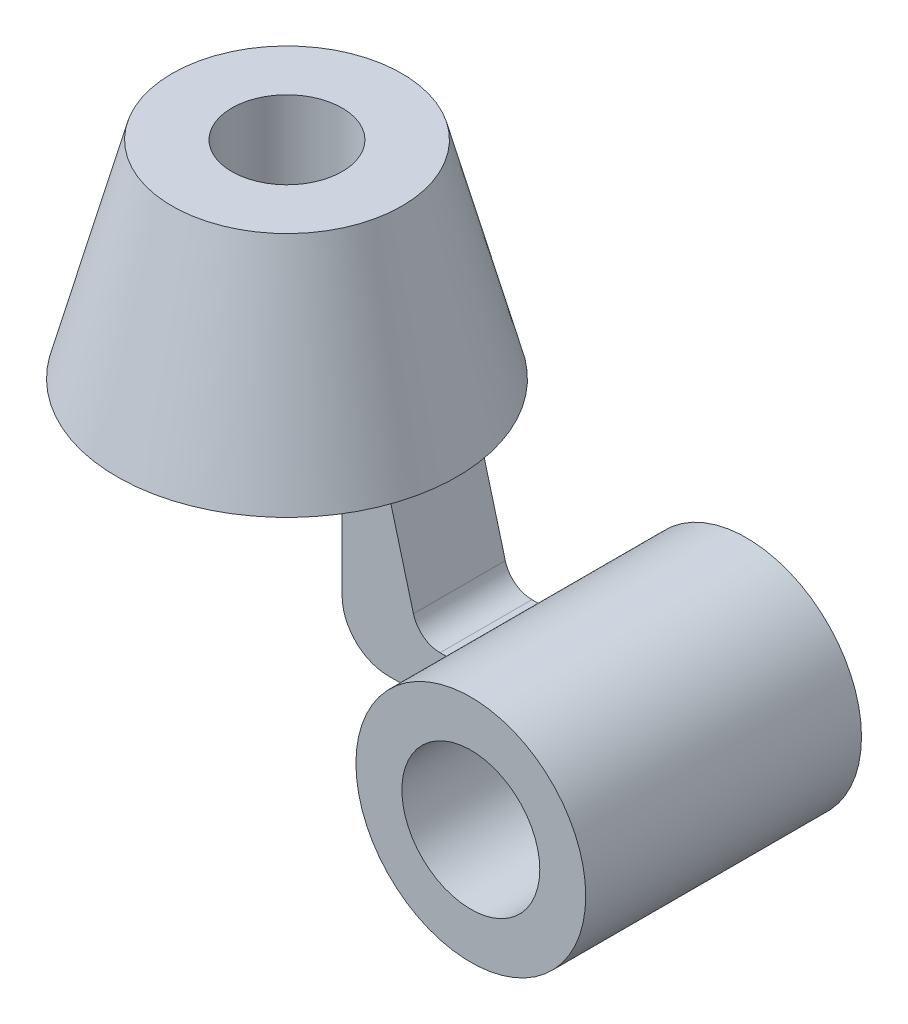
ISO-10303-21;
HEADER;
FILE_DESCRIPTION(('STEP AP214'),'2;1');
FILE_NAME('part.step','',(''),(''),'','','');
FILE_SCHEMA(('AUTOMOTIVE_DESIGN { 1 0 10303 214 1 1 1 1 }'));
ENDSEC;
DATA;
#1=APPLICATION_CONTEXT('core data for automotive mechanical design processes');
#2=APPLICATION_PROTOCOL_DEFINITION('international standard','automotive_design',2000,#1);
#3=PRODUCT_CONTEXT('',#1,'mechanical');
#4=PRODUCT('Part','Part','',(#3));
#5=PRODUCT_RELATED_PRODUCT_CATEGORY('part','',(#4));
#6=PRODUCT_DEFINITION_FORMATION('','',#4);
#7=PRODUCT_DEFINITION_CONTEXT('part definition',#1,'design');
#8=PRODUCT_DEFINITION('design','',#6,#7);
#9=PRODUCT_DEFINITION_SHAPE('','',#8);
#10=(LENGTH_UNIT() NAMED_UNIT(*) SI_UNIT(.MILLI.,.METRE.));
#11=(NAMED_UNIT(*) PLANE_ANGLE_UNIT() SI_UNIT($,.RADIAN.));
#12=(NAMED_UNIT(*) SI_UNIT($,.STERADIAN.) SOLID_ANGLE_UNIT());
#13=UNCERTAINTY_MEASURE_WITH_UNIT(LENGTH_MEASURE(1.E-05),#10,'distance_accuracy_value','');
#14=(GEOMETRIC_REPRESENTATION_CONTEXT(3) GLOBAL_UNCERTAINTY_ASSIGNED_CONTEXT((#13)) GLOBAL_UNIT_ASSIGNED_CONTEXT((#10,
#11,#12)) REPRESENTATION_CONTEXT('',''));
#15=CARTESIAN_POINT('',(0.,0.,0.));
#16=DIRECTION('',(0.,0.,1.));
#17=DIRECTION('',(1.,0.,0.));
#18=AXIS2_PLACEMENT_3D('',#15,#16,#17);
#19=CARTESIAN_POINT('',(50.5747092562656,-35.,10.));
#20=DIRECTION('',(0.,1.,0.));
#21=DIRECTION('',(-1.,0.,0.));
#22=AXIS2_PLACEMENT_3D('',#19,#20,#21);
#23=PLANE('',#22);
#24=DIRECTION('',(0.,0.,-1.));
#25=VECTOR('',#24,1.);
#26=CARTESIAN_POINT('',(45.,-35.,30.));
#27=LINE('',#26,#25);
#28=CARTESIAN_POINT('',(45.,-35.,10.));
#29=VERTEX_POINT('',#28);
#30=CARTESIAN_POINT('',(45.,-35.,-10.));
#31=VERTEX_POINT('',#30);
#32=EDGE_CURVE('E69',#29,#31,#27,.T.);
#33=ORIENTED_EDGE('',*,*,#32,.F.);
#34=DIRECTION('',(1.,0.,0.));
#35=VECTOR('',#34,1.);
#36=CARTESIAN_POINT('',(50.5747092562656,-35.,10.));
#37=LINE('',#36,#35);
#38=CARTESIAN_POINT('',(32.0000000000001,-35.,10.));
#39=VERTEX_POINT('',#38);
#40=EDGE_CURVE('E149',#39,#29,#37,.T.);
#41=ORIENTED_EDGE('',*,*,#40,.F.);
#42=DIRECTION('',(0.,0.,-1.));
#43=VECTOR('',#42,1.);
#44=CARTESIAN_POINT('',(32.0000000000001,-35.,10.));
#45=LINE('',#44,#43);
#46=CARTESIAN_POINT('',(32.0000000000001,-35.,-10.));
#47=VERTEX_POINT('',#46);
#48=EDGE_CURVE('E195',#39,#47,#45,.T.);
#49=ORIENTED_EDGE('',*,*,#48,.T.);
#50=DIRECTION('',(1.,0.,0.));
#51=VECTOR('',#50,1.);
#52=CARTESIAN_POINT('',(50.5747092562656,-35.,-10.));
#53=LINE('',#52,#51);
#54=EDGE_CURVE('E122',#47,#31,#53,.T.);
#55=ORIENTED_EDGE('',*,*,#54,.T.);
#56=EDGE_LOOP('',(#33,#41,#49,#55));
#57=FACE_BOUND('',#56,.T.);
#58=ADVANCED_FACE('F45',(#57),#23,.F.);
#59=CARTESIAN_POINT('',(43.3026917386517,-25.,10.));
#60=DIRECTION('',(0.,-1.,0.));
#61=DIRECTION('',(0.,0.,-1.));
#62=AXIS2_PLACEMENT_3D('',#59,#60,#61);
#63=PLANE('',#62);
#64=DIRECTION('',(0.,0.,-1.));
#65=VECTOR('',#64,1.);
#66=CARTESIAN_POINT('',(47.0871215252208,-25.,30.));
#67=LINE('',#66,#65);
#68=CARTESIAN_POINT('',(47.0871215252208,-25.,-10.));
#69=VERTEX_POINT('',#68);
#70=CARTESIAN_POINT('',(47.0871215252208,-25.,10.));
#71=VERTEX_POINT('',#70);
#72=EDGE_CURVE('E125',#69,#71,#67,.F.);
#73=ORIENTED_EDGE('',*,*,#72,.F.);
#74=DIRECTION('',(-1.,0.,0.));
#75=VECTOR('',#74,1.);
#76=CARTESIAN_POINT('',(43.3026917386517,-25.,-10.));
#77=LINE('',#76,#75);
#78=CARTESIAN_POINT('',(43.3026917386517,-25.,-10.));
#79=VERTEX_POINT('',#78);
#80=EDGE_CURVE('E112',#69,#79,#77,.T.);
#81=ORIENTED_EDGE('',*,*,#80,.T.);
#82=DIRECTION('',(0.,0.,-1.));
#83=VECTOR('',#82,1.);
#84=CARTESIAN_POINT('',(43.3026917386517,-25.,10.));
#85=LINE('',#84,#83);
#86=CARTESIAN_POINT('',(43.3026917386517,-25.,10.));
#87=VERTEX_POINT('',#86);
#88=EDGE_CURVE('E192',#87,#79,#85,.T.);
#89=ORIENTED_EDGE('',*,*,#88,.F.);
#90=DIRECTION('',(-1.,0.,0.));
#91=VECTOR('',#90,1.);
#92=CARTESIAN_POINT('',(43.3026917386517,-25.,10.));
#93=LINE('',#92,#91);
#94=EDGE_CURVE('E127',#71,#87,#93,.T.);
#95=ORIENTED_EDGE('',*,*,#94,.F.);
#96=EDGE_LOOP('',(#73,#81,#89,#95));
#97=FACE_BOUND('',#96,.T.);
#98=ADVANCED_FACE('F126',(#97),#63,.F.);
#99=CARTESIAN_POINT('',(25.,45.,0.));
#100=DIRECTION('',(0.,-1.,0.));
#101=DIRECTION('',(1.,0.,0.));
#102=AXIS2_PLACEMENT_3D('',#99,#100,#101);
#103=PLANE('',#102);
#104=CARTESIAN_POINT('',(0.,45.,0.));
#105=DIRECTION('',(0.,1.,0.));
#106=DIRECTION('',(-1.,0.,0.));
#107=AXIS2_PLACEMENT_3D('',#104,#105,#106);
#108=CIRCLE('',#107,12.);
#109=CARTESIAN_POINT('',(-12.,45.,0.));
#110=VERTEX_POINT('',#109);
#111=EDGE_CURVE('E203',#110,#110,#108,.T.);
#112=ORIENTED_EDGE('',*,*,#111,.F.);
#113=EDGE_LOOP('',(#112));
#114=FACE_BOUND('',#113,.T.);
#115=CARTESIAN_POINT('',(0.,45.,0.));
#116=DIRECTION('',(0.,1.,0.));
#117=DIRECTION('',(-1.,0.,0.));
#118=AXIS2_PLACEMENT_3D('',#115,#116,#117);
#119=CIRCLE('',#118,25.);
#120=CARTESIAN_POINT('',(-25.,45.,0.));
#121=VERTEX_POINT('',#120);
#122=EDGE_CURVE('E208',#121,#121,#119,.T.);
#123=ORIENTED_EDGE('',*,*,#122,.T.);
#124=EDGE_LOOP('',(#123));
#125=FACE_BOUND('',#124,.T.);
#126=ADVANCED_FACE('F47',(#114,#125),#103,.F.);
#127=CARTESIAN_POINT('',(0.,0.,0.));
#128=DIRECTION('',(0.,1.,0.));
#129=DIRECTION('',(-1.,0.,0.));
#130=AXIS2_PLACEMENT_3D('',#127,#128,#129);
#131=PLANE('',#130);
#132=DIRECTION('',(0.,0.,-1.));
#133=VECTOR('',#132,1.);
#134=CARTESIAN_POINT('',(22.,0.,10.));
#135=LINE('',#134,#133);
#136=CARTESIAN_POINT('',(22.,0.,10.));
#137=VERTEX_POINT('',#136);
#138=CARTESIAN_POINT('',(22.,0.,-10.));
#139=VERTEX_POINT('',#138);
#140=EDGE_CURVE('E165',#137,#139,#135,.T.);
#141=ORIENTED_EDGE('',*,*,#140,.F.);
#142=DIRECTION('',(-1.,0.,0.));
#143=VECTOR('',#142,1.);
#144=CARTESIAN_POINT('',(22.,0.,10.));
#145=LINE('',#144,#143);
#146=CARTESIAN_POINT('',(32.,0.,10.));
#147=VERTEX_POINT('',#146);
#148=EDGE_CURVE('E161',#147,#137,#145,.T.);
#149=ORIENTED_EDGE('',*,*,#148,.F.);
#150=DIRECTION('',(0.,0.,-1.));
#151=VECTOR('',#150,1.);
#152=CARTESIAN_POINT('',(32.,0.,10.));
#153=LINE('',#152,#151);
#154=CARTESIAN_POINT('',(32.,0.,-10.));
#155=VERTEX_POINT('',#154);
#156=EDGE_CURVE('E185',#147,#155,#153,.T.);
#157=ORIENTED_EDGE('',*,*,#156,.T.);
#158=DIRECTION('',(-1.,0.,0.));
#159=VECTOR('',#158,1.);
#160=CARTESIAN_POINT('',(22.,0.,-10.));
#161=LINE('',#160,#159);
#162=EDGE_CURVE('E146',#155,#139,#161,.T.);
#163=ORIENTED_EDGE('',*,*,#162,.T.);
#164=EDGE_LOOP('',(#141,#149,#157,#163));
#165=FACE_BOUND('',#164,.T.);
#166=CARTESIAN_POINT('',(0.,0.,0.));
#167=DIRECTION('',(0.,1.,0.));
#168=DIRECTION('',(-1.,0.,0.));
#169=AXIS2_PLACEMENT_3D('',#166,#167,#168);
#170=CIRCLE('',#169,12.);
#171=CARTESIAN_POINT('',(-12.,0.,0.));
#172=VERTEX_POINT('',#171);
#173=EDGE_CURVE('E204',#172,#172,#170,.T.);
#174=ORIENTED_EDGE('',*,*,#173,.T.);
#175=EDGE_LOOP('',(#174));
#176=FACE_BOUND('',#175,.T.);
#177=CARTESIAN_POINT('',(0.,0.,0.));
#178=DIRECTION('',(0.,1.,0.));
#179=DIRECTION('',(-1.,0.,0.));
#180=AXIS2_PLACEMENT_3D('',#177,#178,#179);
#181=CIRCLE('',#180,37.);
#182=CARTESIAN_POINT('',(-37.,0.,0.));
#183=VERTEX_POINT('',#182);
#184=EDGE_CURVE('E54',#183,#183,#181,.T.);
#185=ORIENTED_EDGE('',*,*,#184,.F.);
#186=EDGE_LOOP('',(#185));
#187=FACE_BOUND('',#186,.T.);
#188=ADVANCED_FACE('F220',(#165,#176,#187),#131,.F.);
#189=CARTESIAN_POINT('',(0.,0.,0.));
#190=DIRECTION('',(0.,-1.,0.));
#191=DIRECTION('',(1.,0.,0.));
#192=AXIS2_PLACEMENT_3D('',#189,#190,#191);
#193=CONICAL_SURFACE('',#192,37.,0.260602391747341);
#194=ORIENTED_EDGE('',*,*,#122,.F.);
#195=EDGE_LOOP('',(#194));
#196=FACE_BOUND('',#195,.T.);
#197=ORIENTED_EDGE('',*,*,#184,.T.);
#198=EDGE_LOOP('',(#197));
#199=FACE_BOUND('',#198,.T.);
#200=ADVANCED_FACE('F218',(#196,#199),#193,.T.);
#201=CARTESIAN_POINT('',(0.,0.,0.));
#202=DIRECTION('',(0.,1.,0.));
#203=DIRECTION('',(-1.,0.,0.));
#204=AXIS2_PLACEMENT_3D('',#201,#202,#203);
#205=CYLINDRICAL_SURFACE('',#204,12.);
#206=ORIENTED_EDGE('',*,*,#173,.F.);
#207=EDGE_LOOP('',(#206));
#208=FACE_BOUND('',#207,.T.);
#209=ORIENTED_EDGE('',*,*,#111,.T.);
#210=EDGE_LOOP('',(#209));
#211=FACE_BOUND('',#210,.T.);
#212=ADVANCED_FACE('F228',(#208,#211),#205,.F.);
#213=CARTESIAN_POINT('',(22.,-24.9999999999999,10.));
#214=DIRECTION('',(1.,0.,0.));
#215=DIRECTION('',(0.,0.,-1.));
#216=AXIS2_PLACEMENT_3D('',#213,#214,#215);
#217=PLANE('',#216);
#218=DIRECTION('',(0.,-1.,0.));
#219=VECTOR('',#218,1.);
#220=CARTESIAN_POINT('',(22.,-24.9999999999999,-10.));
#221=LINE('',#220,#219);
#222=CARTESIAN_POINT('',(22.,-25.,-10.));
#223=VERTEX_POINT('',#222);
#224=EDGE_CURVE('E137',#139,#223,#221,.T.);
#225=ORIENTED_EDGE('',*,*,#224,.T.);
#226=DIRECTION('',(0.,0.,-1.));
#227=VECTOR('',#226,1.);
#228=CARTESIAN_POINT('',(22.,-25.,10.));
#229=LINE('',#228,#227);
#230=CARTESIAN_POINT('',(22.,-25.,10.));
#231=VERTEX_POINT('',#230);
#232=EDGE_CURVE('E199',#231,#223,#229,.T.);
#233=ORIENTED_EDGE('',*,*,#232,.F.);
#234=DIRECTION('',(0.,-1.,0.));
#235=VECTOR('',#234,1.);
#236=CARTESIAN_POINT('',(22.,-24.9999999999999,10.));
#237=LINE('',#236,#235);
#238=EDGE_CURVE('E141',#137,#231,#237,.T.);
#239=ORIENTED_EDGE('',*,*,#238,.F.);
#240=ORIENTED_EDGE('',*,*,#140,.T.);
#241=EDGE_LOOP('',(#225,#233,#239,#240));
#242=FACE_BOUND('',#241,.T.);
#243=ADVANCED_FACE('F247',(#242),#217,.F.);
#244=CARTESIAN_POINT('',(32.,-25.,10.));
#245=DIRECTION('',(0.,0.,-1.));
#246=DIRECTION('',(-1.,0.,0.));
#247=AXIS2_PLACEMENT_3D('',#244,#245,#246);
#248=CYLINDRICAL_SURFACE('',#247,10.);
#249=CARTESIAN_POINT('',(32.,-25.,-10.));
#250=DIRECTION('',(0.,0.,1.));
#251=DIRECTION('',(-1.,0.,0.));
#252=AXIS2_PLACEMENT_3D('',#249,#250,#251);
#253=CIRCLE('',#252,10.);
#254=EDGE_CURVE('E169',#223,#47,#253,.T.);
#255=ORIENTED_EDGE('',*,*,#254,.T.);
#256=ORIENTED_EDGE('',*,*,#48,.F.);
#257=CARTESIAN_POINT('',(32.,-25.,10.));
#258=DIRECTION('',(0.,0.,1.));
#259=DIRECTION('',(-1.,0.,0.));
#260=AXIS2_PLACEMENT_3D('',#257,#258,#259);
#261=CIRCLE('',#260,10.);
#262=EDGE_CURVE('E145',#231,#39,#261,.T.);
#263=ORIENTED_EDGE('',*,*,#262,.F.);
#264=ORIENTED_EDGE('',*,*,#232,.T.);
#265=EDGE_LOOP('',(#255,#256,#263,#264));
#266=FACE_BOUND('',#265,.T.);
#267=ADVANCED_FACE('F243',(#266),#248,.T.);
#268=CARTESIAN_POINT('',(43.3026917386517,-19.,10.));
#269=DIRECTION('',(0.,0.,-1.));
#270=DIRECTION('',(-1.,0.,0.));
#271=AXIS2_PLACEMENT_3D('',#268,#269,#270);
#272=CYLINDRICAL_SURFACE('',#271,6.);
#273=CARTESIAN_POINT('',(43.3026917386517,-19.,-10.));
#274=DIRECTION('',(0.,0.,-1.));
#275=DIRECTION('',(1.,0.,0.));
#276=AXIS2_PLACEMENT_3D('',#273,#274,#275);
#277=CIRCLE('',#276,6.);
#278=CARTESIAN_POINT('',(37.5071367809173,-20.552914270615,-10.));
#279=VERTEX_POINT('',#278);
#280=EDGE_CURVE('E117',#79,#279,#277,.T.);
#281=ORIENTED_EDGE('',*,*,#280,.T.);
#282=DIRECTION('',(0.,0.,-1.));
#283=VECTOR('',#282,1.);
#284=CARTESIAN_POINT('',(37.5071367809173,-20.552914270615,10.));
#285=LINE('',#284,#283);
#286=CARTESIAN_POINT('',(37.5071367809173,-20.552914270615,10.));
#287=VERTEX_POINT('',#286);
#288=EDGE_CURVE('E188',#287,#279,#285,.T.);
#289=ORIENTED_EDGE('',*,*,#288,.F.);
#290=CARTESIAN_POINT('',(43.3026917386517,-19.,10.));
#291=DIRECTION('',(0.,0.,-1.));
#292=DIRECTION('',(1.,0.,0.));
#293=AXIS2_PLACEMENT_3D('',#290,#291,#292);
#294=CIRCLE('',#293,6.);
#295=EDGE_CURVE('E154',#87,#287,#294,.T.);
#296=ORIENTED_EDGE('',*,*,#295,.F.);
#297=ORIENTED_EDGE('',*,*,#88,.T.);
#298=EDGE_LOOP('',(#281,#289,#296,#297));
#299=FACE_BOUND('',#298,.T.);
#300=ADVANCED_FACE('F246',(#299),#272,.F.);
#301=CARTESIAN_POINT('',(32.,0.,10.));
#302=DIRECTION('',(-0.96592582628907,-0.258819045102514,0.));
#303=DIRECTION('',(0.258819045102514,-0.96592582628907,0.));
#304=AXIS2_PLACEMENT_3D('',#301,#302,#303);
#305=PLANE('',#304);
#306=DIRECTION('',(-0.258819045102514,0.96592582628907,0.));
#307=VECTOR('',#306,1.);
#308=CARTESIAN_POINT('',(32.,0.,-10.));
#309=LINE('',#308,#307);
#310=EDGE_CURVE('E176',#279,#155,#309,.T.);
#311=ORIENTED_EDGE('',*,*,#310,.T.);
#312=ORIENTED_EDGE('',*,*,#156,.F.);
#313=DIRECTION('',(-0.258819045102514,0.96592582628907,0.));
#314=VECTOR('',#313,1.);
#315=CARTESIAN_POINT('',(32.,0.,10.));
#316=LINE('',#315,#314);
#317=EDGE_CURVE('E157',#287,#147,#316,.T.);
#318=ORIENTED_EDGE('',*,*,#317,.F.);
#319=ORIENTED_EDGE('',*,*,#288,.T.);
#320=EDGE_LOOP('',(#311,#312,#318,#319));
#321=FACE_BOUND('',#320,.T.);
#322=ADVANCED_FACE('F294',(#321),#305,.F.);
#323=CARTESIAN_POINT('',(43.3026917386517,-19.,10.));
#324=DIRECTION('',(0.,0.,1.));
#325=DIRECTION('',(1.,0.,0.));
#326=AXIS2_PLACEMENT_3D('',#323,#324,#325);
#327=PLANE('',#326);
#328=ORIENTED_EDGE('',*,*,#40,.T.);
#329=CARTESIAN_POINT('',(70.,-35.,10.));
#330=DIRECTION('',(0.,0.,1.));
#331=DIRECTION('',(1.,0.,0.));
#332=AXIS2_PLACEMENT_3D('',#329,#330,#331);
#333=CIRCLE('',#332,25.);
#334=EDGE_CURVE('E61',#29,#71,#333,.F.);
#335=ORIENTED_EDGE('',*,*,#334,.T.);
#336=ORIENTED_EDGE('',*,*,#94,.T.);
#337=ORIENTED_EDGE('',*,*,#295,.T.);
#338=ORIENTED_EDGE('',*,*,#317,.T.);
#339=ORIENTED_EDGE('',*,*,#148,.T.);
#340=ORIENTED_EDGE('',*,*,#238,.T.);
#341=ORIENTED_EDGE('',*,*,#262,.T.);
#342=EDGE_LOOP('',(#328,#335,#336,#337,#338,#339,#340,#341));
#343=FACE_BOUND('',#342,.T.);
#344=ADVANCED_FACE('F301',(#343),#327,.T.);
#345=CARTESIAN_POINT('',(43.3026917386517,-19.,-10.));
#346=DIRECTION('',(0.,0.,1.));
#347=DIRECTION('',(1.,0.,0.));
#348=AXIS2_PLACEMENT_3D('',#345,#346,#347);
#349=PLANE('',#348);
#350=CARTESIAN_POINT('',(70.,-35.,-10.));
#351=DIRECTION('',(0.,0.,1.));
#352=DIRECTION('',(1.,0.,0.));
#353=AXIS2_PLACEMENT_3D('',#350,#351,#352);
#354=CIRCLE('',#353,25.);
#355=EDGE_CURVE('E11',#31,#69,#354,.F.);
#356=ORIENTED_EDGE('',*,*,#355,.F.);
#357=ORIENTED_EDGE('',*,*,#54,.F.);
#358=ORIENTED_EDGE('',*,*,#254,.F.);
#359=ORIENTED_EDGE('',*,*,#224,.F.);
#360=ORIENTED_EDGE('',*,*,#162,.F.);
#361=ORIENTED_EDGE('',*,*,#310,.F.);
#362=ORIENTED_EDGE('',*,*,#280,.F.);
#363=ORIENTED_EDGE('',*,*,#80,.F.);
#364=EDGE_LOOP('',(#356,#357,#358,#359,#360,#361,#362,#363));
#365=FACE_BOUND('',#364,.T.);
#366=ADVANCED_FACE('F114',(#365),#349,.F.);
#367=CARTESIAN_POINT('',(70.,-35.,30.));
#368=DIRECTION('',(0.,0.,1.));
#369=DIRECTION('',(1.,0.,0.));
#370=AXIS2_PLACEMENT_3D('',#367,#368,#369);
#371=PLANE('',#370);
#372=CARTESIAN_POINT('',(70.,-35.,30.));
#373=DIRECTION('',(0.,0.,1.));
#374=DIRECTION('',(1.,0.,0.));
#375=AXIS2_PLACEMENT_3D('',#372,#373,#374);
#376=CIRCLE('',#375,25.);
#377=CARTESIAN_POINT('',(95.,-35.,30.));
#378=VERTEX_POINT('',#377);
#379=EDGE_CURVE('E130',#378,#378,#376,.T.);
#380=ORIENTED_EDGE('',*,*,#379,.T.);
#381=EDGE_LOOP('',(#380));
#382=FACE_BOUND('',#381,.T.);
#383=CARTESIAN_POINT('',(70.,-35.,30.));
#384=DIRECTION('',(0.,0.,1.));
#385=DIRECTION('',(1.,0.,0.));
#386=AXIS2_PLACEMENT_3D('',#383,#384,#385);
#387=CIRCLE('',#386,15.);
#388=CARTESIAN_POINT('',(85.,-35.,30.));
#389=VERTEX_POINT('',#388);
#390=EDGE_CURVE('E372',#389,#389,#387,.T.);
#391=ORIENTED_EDGE('',*,*,#390,.F.);
#392=EDGE_LOOP('',(#391));
#393=FACE_BOUND('',#392,.T.);
#394=ADVANCED_FACE('F317',(#382,#393),#371,.T.);
#395=CARTESIAN_POINT('',(70.,-35.,-30.));
#396=DIRECTION('',(0.,0.,1.));
#397=DIRECTION('',(1.,0.,0.));
#398=AXIS2_PLACEMENT_3D('',#395,#396,#397);
#399=PLANE('',#398);
#400=CARTESIAN_POINT('',(70.,-35.,-30.));
#401=DIRECTION('',(0.,0.,1.));
#402=DIRECTION('',(1.,0.,0.));
#403=AXIS2_PLACEMENT_3D('',#400,#401,#402);
#404=CIRCLE('',#403,25.);
#405=CARTESIAN_POINT('',(95.,-35.,-30.));
#406=VERTEX_POINT('',#405);
#407=EDGE_CURVE('E380',#406,#406,#404,.T.);
#408=ORIENTED_EDGE('',*,*,#407,.F.);
#409=EDGE_LOOP('',(#408));
#410=FACE_BOUND('',#409,.T.);
#411=CARTESIAN_POINT('',(70.,-35.,-30.));
#412=DIRECTION('',(0.,0.,1.));
#413=DIRECTION('',(1.,0.,0.));
#414=AXIS2_PLACEMENT_3D('',#411,#412,#413);
#415=CIRCLE('',#414,15.);
#416=CARTESIAN_POINT('',(85.,-35.,-30.));
#417=VERTEX_POINT('',#416);
#418=EDGE_CURVE('E375',#417,#417,#415,.T.);
#419=ORIENTED_EDGE('',*,*,#418,.T.);
#420=EDGE_LOOP('',(#419));
#421=FACE_BOUND('',#420,.T.);
#422=ADVANCED_FACE('F335',(#410,#421),#399,.F.);
#423=CARTESIAN_POINT('',(70.,-35.,30.));
#424=DIRECTION('',(0.,0.,-1.));
#425=DIRECTION('',(-1.,0.,0.));
#426=AXIS2_PLACEMENT_3D('',#423,#424,#425);
#427=CYLINDRICAL_SURFACE('',#426,25.);
#428=ORIENTED_EDGE('',*,*,#334,.F.);
#429=ORIENTED_EDGE('',*,*,#32,.T.);
#430=ORIENTED_EDGE('',*,*,#355,.T.);
#431=ORIENTED_EDGE('',*,*,#72,.T.);
#432=EDGE_LOOP('',(#428,#429,#430,#431));
#433=FACE_BOUND('',#432,.T.);
#434=ORIENTED_EDGE('',*,*,#379,.F.);
#435=EDGE_LOOP('',(#434));
#436=FACE_BOUND('',#435,.T.);
#437=ORIENTED_EDGE('',*,*,#407,.T.);
#438=EDGE_LOOP('',(#437));
#439=FACE_BOUND('',#438,.T.);
#440=ADVANCED_FACE('F132',(#433,#436,#439),#427,.T.);
#441=CARTESIAN_POINT('',(70.,-35.,30.));
#442=DIRECTION('',(0.,0.,-1.));
#443=DIRECTION('',(-1.,0.,0.));
#444=AXIS2_PLACEMENT_3D('',#441,#442,#443);
#445=CYLINDRICAL_SURFACE('',#444,15.);
#446=ORIENTED_EDGE('',*,*,#390,.T.);
#447=EDGE_LOOP('',(#446));
#448=FACE_BOUND('',#447,.T.);
#449=ORIENTED_EDGE('',*,*,#418,.F.);
#450=EDGE_LOOP('',(#449));
#451=FACE_BOUND('',#450,.T.);
#452=ADVANCED_FACE('F352',(#448,#451),#445,.F.);
#453=CLOSED_SHELL('',(#58,#98,#126,#188,#200,#212,#243,#267,#300,#322,#344,#366,#394,#422,#440,#452));
#454=MANIFOLD_SOLID_BREP('B2',#453);
#455=ADVANCED_BREP_SHAPE_REPRESENTATION('',(#18,#454),#14);
#456=SHAPE_DEFINITION_REPRESENTATION(#9,#455);
ENDSEC;
END-ISO-10303-21;
